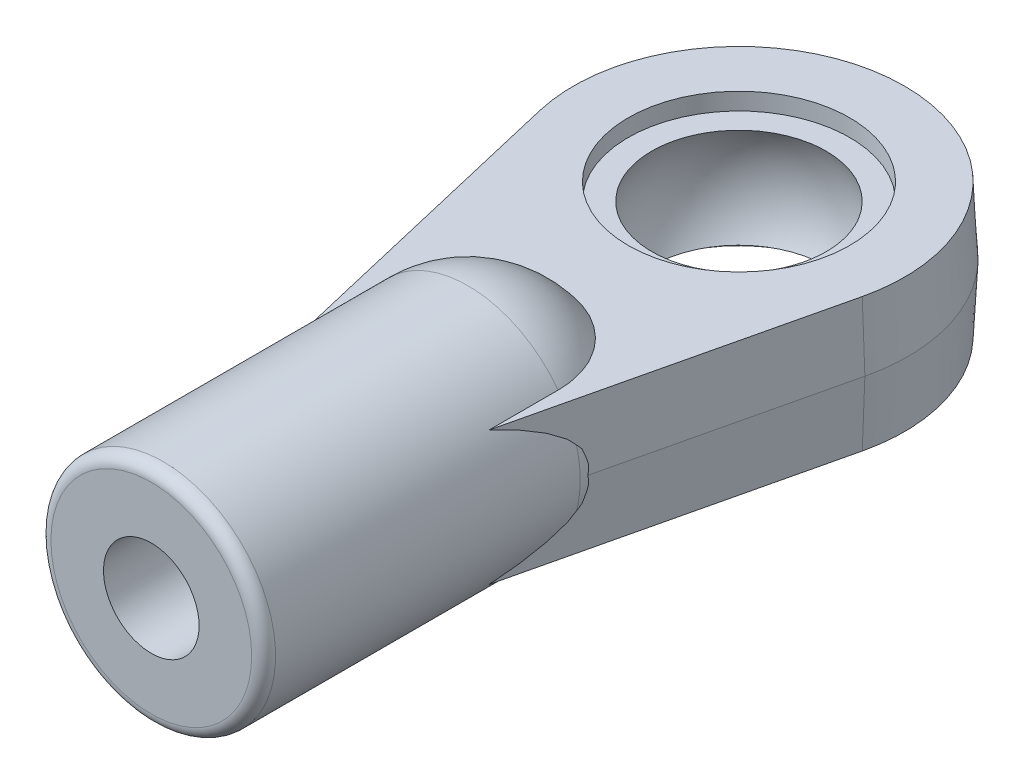
ISO-10303-21;
HEADER;
FILE_DESCRIPTION(('STEP AP214'),'2;1');
FILE_NAME('part.step','',(''),(''),'','','');
FILE_SCHEMA(('AUTOMOTIVE_DESIGN { 1 0 10303 214 1 1 1 1 }'));
ENDSEC;
DATA;
#1=APPLICATION_CONTEXT('core data for automotive mechanical design processes');
#2=APPLICATION_PROTOCOL_DEFINITION('international standard','automotive_design',2000,#1);
#3=PRODUCT_CONTEXT('',#1,'mechanical');
#4=PRODUCT('Part','Part','',(#3));
#5=PRODUCT_RELATED_PRODUCT_CATEGORY('part','',(#4));
#6=PRODUCT_DEFINITION_FORMATION('','',#4);
#7=PRODUCT_DEFINITION_CONTEXT('part definition',#1,'design');
#8=PRODUCT_DEFINITION('design','',#6,#7);
#9=PRODUCT_DEFINITION_SHAPE('','',#8);
#10=(LENGTH_UNIT() NAMED_UNIT(*) SI_UNIT(.MILLI.,.METRE.));
#11=(NAMED_UNIT(*) PLANE_ANGLE_UNIT() SI_UNIT($,.RADIAN.));
#12=(NAMED_UNIT(*) SI_UNIT($,.STERADIAN.) SOLID_ANGLE_UNIT());
#13=UNCERTAINTY_MEASURE_WITH_UNIT(LENGTH_MEASURE(1.E-05),#10,'distance_accuracy_value','');
#14=(GEOMETRIC_REPRESENTATION_CONTEXT(3) GLOBAL_UNCERTAINTY_ASSIGNED_CONTEXT((#13)) GLOBAL_UNIT_ASSIGNED_CONTEXT((#10,
#11,#12)) REPRESENTATION_CONTEXT('',''));
#15=CARTESIAN_POINT('',(0.,0.,0.));
#16=DIRECTION('',(0.,0.,1.));
#17=DIRECTION('',(1.,0.,0.));
#18=AXIS2_PLACEMENT_3D('',#15,#16,#17);
#19=CARTESIAN_POINT('',(0.,1.5875,-18.73885));
#20=DIRECTION('',(0.,1.,0.));
#21=DIRECTION('',(0.,0.,1.));
#22=AXIS2_PLACEMENT_3D('',#19,#20,#21);
#23=PLANE('',#22);
#24=CARTESIAN_POINT('',(0.,1.5875,-18.73885));
#25=DIRECTION('',(0.,1.,0.));
#26=DIRECTION('',(0.,0.,1.));
#27=AXIS2_PLACEMENT_3D('',#24,#25,#26);
#28=CIRCLE('',#27,3.5306);
#29=CARTESIAN_POINT('',(0.,1.5875,-15.20825));
#30=VERTEX_POINT('',#29);
#31=EDGE_CURVE('P0_E21',#30,#30,#28,.T.);
#32=ORIENTED_EDGE('',*,*,#31,.T.);
#33=EDGE_LOOP('',(#32));
#34=FACE_BOUND('',#33,.T.);
#35=CARTESIAN_POINT('',(0.,1.5875,-21.5177713572895));
#36=CARTESIAN_POINT('',(0.0780233970109175,1.5875,-21.5177708897208));
#37=CARTESIAN_POINT('',(0.156061132928654,1.5875,-21.5144824409786));
#38=CARTESIAN_POINT('',(0.311597316268005,1.5875,-21.5013500255618));
#39=CARTESIAN_POINT('',(0.38909559764727,1.5875,-21.4915041234929));
#40=CARTESIAN_POINT('',(0.543117688376616,1.5875,-21.4653010984848));
#41=CARTESIAN_POINT('',(0.61963975090967,1.5875,-21.4489336397251));
#42=CARTESIAN_POINT('',(0.771075578611785,1.5875,-21.4098003250142));
#43=CARTESIAN_POINT('',(0.845987985313132,1.5875,-21.3870292767222));
#44=CARTESIAN_POINT('',(1.06718751098859,1.5875,-21.3094255696959));
#45=CARTESIAN_POINT('',(1.21030919565112,1.5875,-21.2452386063567));
#46=CARTESIAN_POINT('',(1.48372914335094,1.5875,-21.093713605579));
#47=CARTESIAN_POINT('',(1.61402691865729,1.5875,-21.0063746880698));
#48=CARTESIAN_POINT('',(1.7970247350954,1.5875,-20.8599907156731));
#49=CARTESIAN_POINT('',(1.85598367192579,1.5875,-20.808594810804));
#50=CARTESIAN_POINT('',(1.96932163723164,1.5875,-20.7010594238807));
#51=CARTESIAN_POINT('',(2.02370502662113,1.5875,-20.6449245631263));
#52=CARTESIAN_POINT('',(2.12757332441993,1.5875,-20.5282461366586));
#53=CARTESIAN_POINT('',(2.17705600269889,1.5875,-20.4677005853578));
#54=CARTESIAN_POINT('',(2.27074994631359,1.5875,-20.3426616964005));
#55=CARTESIAN_POINT('',(2.31495998807603,1.5875,-20.2781674476397));
#56=CARTESIAN_POINT('',(2.43915822774601,1.5875,-20.0794648960385));
#57=CARTESIAN_POINT('',(2.51082410606128,1.5875,-19.9399134812632));
#58=CARTESIAN_POINT('',(2.62966634363635,1.5875,-19.6508349270353));
#59=CARTESIAN_POINT('',(2.67684296445287,1.5875,-19.5013078941462));
#60=CARTESIAN_POINT('',(2.74543580972441,1.5875,-19.1964365865845));
#61=CARTESIAN_POINT('',(2.76685189660724,1.5875,-19.0410922808496));
#62=CARTESIAN_POINT('',(2.78329356222039,1.5875,-18.7290133036645));
#63=CARTESIAN_POINT('',(2.77831914095071,1.5875,-18.5722786322141));
#64=CARTESIAN_POINT('',(2.74214097095968,1.5875,-18.2618875359936));
#65=CARTESIAN_POINT('',(2.71093736231285,1.5875,-18.108231094789));
#66=CARTESIAN_POINT('',(2.62312852141531,1.5875,-17.8082652710581));
#67=CARTESIAN_POINT('',(2.56652301785846,1.5875,-17.6619559670218));
#68=CARTESIAN_POINT('',(2.46389138915448,1.5875,-17.4513030402927));
#69=CARTESIAN_POINT('',(2.42670294999351,1.5875,-17.3825203687204));
#70=CARTESIAN_POINT('',(2.34666639430291,1.5875,-17.2483286082619));
#71=CARTESIAN_POINT('',(2.30381959030906,1.5875,-17.1829187418847));
#72=CARTESIAN_POINT('',(2.21278651269454,1.5875,-17.0559720709137));
#73=CARTESIAN_POINT('',(2.16460266549794,1.5875,-16.9944335260597));
#74=CARTESIAN_POINT('',(2.06319162073477,1.5875,-16.8755842356939));
#75=CARTESIAN_POINT('',(2.00995960080364,1.5875,-16.8182776276671));
#76=CARTESIAN_POINT('',(1.84335642684013,1.5875,-16.653475168277));
#77=CARTESIAN_POINT('',(1.72295727630919,1.58750000000001,-16.5529284561832));
#78=CARTESIAN_POINT('',(1.46697274328732,1.58749999999999,-16.3735121455689));
#79=CARTESIAN_POINT('',(1.33138793830244,1.58749999999997,-16.2946417230992));
#80=CARTESIAN_POINT('',(1.11956731470582,1.58749999999998,-16.1942246482444));
#81=CARTESIAN_POINT('',(1.04746232878977,1.5875,-16.163708090048));
#82=CARTESIAN_POINT('',(0.900976845737199,1.58750000000001,-16.1088789966126));
#83=CARTESIAN_POINT('',(0.826598245143451,1.5875,-16.0845614405207));
#84=CARTESIAN_POINT('',(0.676182140780832,1.5875,-16.0423192992328));
#85=CARTESIAN_POINT('',(0.60014746021542,1.5875,-16.0243846189846));
#86=CARTESIAN_POINT('',(0.446852225135867,1.5875,-15.9949816333477));
#87=CARTESIAN_POINT('',(0.369592039110233,1.5875,-15.9835114207263));
#88=CARTESIAN_POINT('',(0.243510088508142,1.5875,-15.9701885983606));
#89=CARTESIAN_POINT('',(0.194890190052977,1.5875,-15.9663423325502));
#90=CARTESIAN_POINT('',(0.0975153944611177,1.5875,-15.9612122086222));
#91=CARTESIAN_POINT('',(0.0487604973244243,1.5875,-15.9599283505047));
#92=CARTESIAN_POINT('',(-0.0780233970109172,1.5875,-15.9599291102792));
#93=CARTESIAN_POINT('',(-0.156061132928654,1.5875,-15.9632175590214));
#94=CARTESIAN_POINT('',(-0.311597316268005,1.5875,-15.9763499744382));
#95=CARTESIAN_POINT('',(-0.38909559764727,1.5875,-15.9861958765071));
#96=CARTESIAN_POINT('',(-0.543117688376615,1.5875,-16.0123989015152));
#97=CARTESIAN_POINT('',(-0.619639750909669,1.5875,-16.0287663602749));
#98=CARTESIAN_POINT('',(-0.771075578611784,1.5875,-16.0678996749858));
#99=CARTESIAN_POINT('',(-0.845987985313132,1.5875,-16.0906707232778));
#100=CARTESIAN_POINT('',(-1.06718751098859,1.5875,-16.1682744303041));
#101=CARTESIAN_POINT('',(-1.21030919565111,1.5875,-16.2324613936433));
#102=CARTESIAN_POINT('',(-1.48372914335094,1.5875,-16.383986394421));
#103=CARTESIAN_POINT('',(-1.61402691865729,1.5875,-16.4713253119302));
#104=CARTESIAN_POINT('',(-1.7970247350954,1.5875,-16.6177092843269));
#105=CARTESIAN_POINT('',(-1.85598367192579,1.5875,-16.669105189196));
#106=CARTESIAN_POINT('',(-1.96932163723163,1.5875,-16.7766405761193));
#107=CARTESIAN_POINT('',(-2.02370502662112,1.5875,-16.8327754368737));
#108=CARTESIAN_POINT('',(-2.12757332441993,1.5875,-16.9494538633414));
#109=CARTESIAN_POINT('',(-2.17705600269889,1.5875,-17.0099994146421));
#110=CARTESIAN_POINT('',(-2.27074994631359,1.5875,-17.1350383035995));
#111=CARTESIAN_POINT('',(-2.31495998807602,1.5875,-17.1995325523603));
#112=CARTESIAN_POINT('',(-2.43915822774601,1.5875,-17.3982351039615));
#113=CARTESIAN_POINT('',(-2.51082410606128,1.5875,-17.5377865187368));
#114=CARTESIAN_POINT('',(-2.62966634363635,1.5875,-17.8268650729647));
#115=CARTESIAN_POINT('',(-2.67684296445287,1.5875,-17.9763921058538));
#116=CARTESIAN_POINT('',(-2.74543580972441,1.5875,-18.2812634134155));
#117=CARTESIAN_POINT('',(-2.76685189660724,1.5875,-18.4366077191504));
#118=CARTESIAN_POINT('',(-2.78329356222039,1.5875,-18.7486866963355));
#119=CARTESIAN_POINT('',(-2.77831914095071,1.5875,-18.9054213677859));
#120=CARTESIAN_POINT('',(-2.74214097095968,1.5875,-19.2158124640064));
#121=CARTESIAN_POINT('',(-2.71093736231285,1.5875,-19.369468905211));
#122=CARTESIAN_POINT('',(-2.62312852141531,1.5875,-19.6694347289419));
#123=CARTESIAN_POINT('',(-2.56652301785846,1.5875,-19.8157440329782));
#124=CARTESIAN_POINT('',(-2.46389138915447,1.5875,-20.0263969597073));
#125=CARTESIAN_POINT('',(-2.42670294999351,1.5875,-20.0951796312795));
#126=CARTESIAN_POINT('',(-2.34666639430291,1.5875,-20.2293713917381));
#127=CARTESIAN_POINT('',(-2.30381959030906,1.5875,-20.2947812581153));
#128=CARTESIAN_POINT('',(-2.21278651269455,1.5875,-20.4217279290863));
#129=CARTESIAN_POINT('',(-2.16460266549794,1.5875,-20.4832664739403));
#130=CARTESIAN_POINT('',(-2.06319162073478,1.5875,-20.6021157643061));
#131=CARTESIAN_POINT('',(-2.00995960080364,1.5875,-20.6594223723328));
#132=CARTESIAN_POINT('',(-1.84335642684014,1.5875,-20.824224831723));
#133=CARTESIAN_POINT('',(-1.7229572763092,1.58750000000001,-20.9247715438168));
#134=CARTESIAN_POINT('',(-1.46697274328732,1.58749999999999,-21.1041878544311));
#135=CARTESIAN_POINT('',(-1.33138793830245,1.58749999999996,-21.1830582769008));
#136=CARTESIAN_POINT('',(-1.11956731470582,1.58749999999998,-21.2834753517556));
#137=CARTESIAN_POINT('',(-1.04746232878977,1.58749999999999,-21.313991909952));
#138=CARTESIAN_POINT('',(-0.900976845737205,1.58750000000001,-21.3688210033874));
#139=CARTESIAN_POINT('',(-0.826598245143456,1.5875,-21.3931385594793));
#140=CARTESIAN_POINT('',(-0.676182140780837,1.5875,-21.4353807007672));
#141=CARTESIAN_POINT('',(-0.600147460215425,1.5875,-21.4533153810154));
#142=CARTESIAN_POINT('',(-0.446852225135871,1.5875,-21.4827183666523));
#143=CARTESIAN_POINT('',(-0.369592039110237,1.5875,-21.4941885792737));
#144=CARTESIAN_POINT('',(-0.243510088508145,1.5875,-21.5075114016394));
#145=CARTESIAN_POINT('',(-0.194890190052979,1.5875,-21.5113576674498));
#146=CARTESIAN_POINT('',(-0.0975153944611187,1.5875,-21.5164877913778));
#147=CARTESIAN_POINT('',(-0.0487604973244245,1.5875,-21.5177716494953));
#148=CARTESIAN_POINT('',(0.,1.5875,-21.5177713572895));
#149=B_SPLINE_CURVE_WITH_KNOTS('',3,(#35,#36,#37,#38,#39,#40,#41,#42,#43,#44,#45,#46,#47,#48,
#49,#50,#51,#52,#53,#54,#55,#56,#57,#58,#59,#60,#61,#62,#63,#64,#65,#66,#67,#68,#69,#70,#71,#72,
#73,#74,#75,#76,#77,#78,#79,#80,#81,#82,#83,#84,#85,#86,#87,#88,#89,#90,#91,#92,#93,#94,#95,#96,
#97,#98,#99,#100,#101,#102,#103,#104,#105,#106,#107,#108,#109,#110,#111,#112,#113,#114,#115,
#116,#117,#118,#119,#120,#121,#122,#123,#124,#125,#126,#127,#128,#129,#130,#131,#132,#133,#134,
#135,#136,#137,#138,#139,#140,#141,#142,#143,#144,#145,#146,#147,#148),.UNSPECIFIED.,.T.,.F.,(4,
2,2,2,2,2,2,2,2,2,2,2,2,2,2,2,2,2,2,2,2,2,2,2,2,2,2,2,2,2,2,2,2,2,2,2,2,2,2,2,2,2,2,2,2,2,2,2,2,
2,2,2,2,2,2,2,4),(0.,0.234025302373472,0.46811970658274,0.702586605236248,0.93724417192487,
1.40544072040476,1.87365506889924,2.10806901100275,2.34225694275971,2.57655095968591,
2.81089924175706,3.27910719063613,3.74731013873254,4.21551558722033,4.68372103570813,
5.15192398380455,5.62013193268361,5.85448021475476,6.08877423168096,6.32296216343792,
6.55737610554143,7.02559045403588,7.49378700251573,7.72844456920437,7.9629114678579,
8.19700587206719,8.43103117444068,8.57728461337557,8.72353805231047,8.95756335468394,
9.19165775889321,9.42612465754672,9.66078222423534,10.1289787727152,10.5971931212097,
10.8316070633132,11.0657949950702,11.3000890119964,11.5344372940675,12.0026452429466,
12.470848191043,12.9390536395308,13.4072590880186,13.875462036115,14.3436699849941,
14.5780182670652,14.8123122839914,15.0465002157484,15.2809141578519,15.7491285063463,
16.2173250548262,16.4519826215148,16.6864495201684,16.9205439243777,17.1545692267511,
17.300822665686,17.4470761046209),.UNSPECIFIED.);
#150=CARTESIAN_POINT('',(0.,1.5875,-21.5177713572895));
#151=VERTEX_POINT('',#150);
#152=EDGE_CURVE('P0_E244',#151,#151,#149,.T.);
#153=ORIENTED_EDGE('',*,*,#152,.T.);
#154=EDGE_LOOP('',(#153));
#155=FACE_BOUND('',#154,.T.);
#156=ADVANCED_FACE('P0_F17',(#34,#155),#23,.T.);
#157=CARTESIAN_POINT('',(0.,1.5875,-18.73885));
#158=DIRECTION('',(0.,1.,0.));
#159=DIRECTION('',(0.,0.,1.));
#160=AXIS2_PLACEMENT_3D('',#157,#158,#159);
#161=CYLINDRICAL_SURFACE('',#160,3.5306);
#162=CARTESIAN_POINT('',(0.,2.1336,-18.73885));
#163=DIRECTION('',(0.,1.,0.));
#164=DIRECTION('',(0.,0.,1.));
#165=AXIS2_PLACEMENT_3D('',#162,#163,#164);
#166=CIRCLE('',#165,3.5306);
#167=CARTESIAN_POINT('',(0.,2.1336,-15.20825));
#168=VERTEX_POINT('',#167);
#169=EDGE_CURVE('P0_E239',#168,#168,#166,.F.);
#170=ORIENTED_EDGE('',*,*,#169,.F.);
#171=EDGE_LOOP('',(#170));
#172=FACE_BOUND('',#171,.T.);
#173=ORIENTED_EDGE('',*,*,#31,.F.);
#174=EDGE_LOOP('',(#173));
#175=FACE_BOUND('',#174,.T.);
#176=ADVANCED_FACE('P0_F77',(#172,#175),#161,.F.);
#177=CARTESIAN_POINT('',(0.,0.,-12.0142000001238));
#178=DIRECTION('',(0.,0.,1.));
#179=DIRECTION('',(1.,0.,0.));
#180=AXIS2_PLACEMENT_3D('',#177,#178,#179);
#181=CONICAL_SURFACE('',#180,1.52399999979025,1.02974425846679);
#182=CARTESIAN_POINT('',(-2.55795384873636E-10,0.,-12.9299115835408));
#183=VERTEX_POINT('',#182);
#184=VERTEX_LOOP('',#183);
#185=FACE_BOUND('',#184,.T.);
#186=CARTESIAN_POINT('',(0.,0.,-12.0142));
#187=DIRECTION('',(0.,0.,1.));
#188=DIRECTION('',(1.,0.,0.));
#189=AXIS2_PLACEMENT_3D('',#186,#187,#188);
#190=CIRCLE('',#189,1.524);
#191=CARTESIAN_POINT('',(1.524,0.,-12.0142));
#192=VERTEX_POINT('',#191);
#193=EDGE_CURVE('P0_E81',#192,#192,#190,.T.);
#194=ORIENTED_EDGE('',*,*,#193,.T.);
#195=EDGE_LOOP('',(#194));
#196=FACE_BOUND('',#195,.T.);
#197=ADVANCED_FACE('P0_F73',(#185,#196),#181,.F.);
#198=CARTESIAN_POINT('',(-2.62620354632618,0.,-6.35));
#199=DIRECTION('',(0.,0.0523359562429439,0.998629534754574));
#200=DIRECTION('',(0.,-0.998629534754574,0.0523359562429439));
#201=AXIS2_PLACEMENT_3D('',#198,#199,#200);
#202=PLANE('',#201);
#203=DIRECTION('',(1.,0.,0.));
#204=VECTOR('',#203,1.);
#205=CARTESIAN_POINT('',(0.,2.1336,-6.4618172378783));
#206=LINE('',#205,#204);
#207=CARTESIAN_POINT('',(-2.53762061529938,2.1336,-6.4618172378783));
#208=VERTEX_POINT('',#207);
#209=CARTESIAN_POINT('',(2.53762061529963,2.1336,-6.4618172378783));
#210=VERTEX_POINT('',#209);
#211=EDGE_CURVE('P0_E230',#208,#210,#206,.T.);
#212=ORIENTED_EDGE('',*,*,#211,.F.);
#213=DIRECTION('',(0.0414255695402248,0.997772303834552,-0.0522910306740929));
#214=VECTOR('',#213,1.);
#215=CARTESIAN_POINT('',(-2.62620354632618,0.,-6.35));
#216=LINE('',#215,#214);
#217=CARTESIAN_POINT('',(-2.62620354632618,0.,-6.35));
#218=VERTEX_POINT('',#217);
#219=EDGE_CURVE('P0_E89',#218,#208,#216,.T.);
#220=ORIENTED_EDGE('',*,*,#219,.F.);
#221=DIRECTION('',(1.,0.,0.));
#222=VECTOR('',#221,1.);
#223=CARTESIAN_POINT('',(-2.62620354632618,0.,-6.35));
#224=LINE('',#223,#222);
#225=CARTESIAN_POINT('',(-1.524,0.,-6.35));
#226=VERTEX_POINT('',#225);
#227=EDGE_CURVE('P0_E69',#218,#226,#224,.T.);
#228=ORIENTED_EDGE('',*,*,#227,.T.);
#229=CARTESIAN_POINT('',(0.,0.,-6.35));
#230=DIRECTION('',(0.,0.0523359562429439,0.998629534754574));
#231=DIRECTION('',(0.,-0.998629534754574,0.0523359562429439));
#232=AXIS2_PLACEMENT_3D('',#229,#230,#231);
#233=ELLIPSE('',#232,1.52609145530083,1.524);
#234=CARTESIAN_POINT('',(1.524,0.,-6.35));
#235=VERTEX_POINT('',#234);
#236=EDGE_CURVE('P0_E240',#226,#235,#233,.F.);
#237=ORIENTED_EDGE('',*,*,#236,.T.);
#238=DIRECTION('',(1.,0.,0.));
#239=VECTOR('',#238,1.);
#240=CARTESIAN_POINT('',(-2.62620354632618,0.,-6.35));
#241=LINE('',#240,#239);
#242=CARTESIAN_POINT('',(2.62620354632643,0.,-6.35));
#243=VERTEX_POINT('',#242);
#244=EDGE_CURVE('P0_E181',#235,#243,#241,.T.);
#245=ORIENTED_EDGE('',*,*,#244,.T.);
#246=DIRECTION('',(0.0414255695402248,-0.997772303834552,0.0522910306740929));
#247=VECTOR('',#246,1.);
#248=CARTESIAN_POINT('',(2.53762061529963,2.1336,-6.4618172378783));
#249=LINE('',#248,#247);
#250=EDGE_CURVE('P0_E87',#210,#243,#249,.T.);
#251=ORIENTED_EDGE('',*,*,#250,.F.);
#252=EDGE_LOOP('',(#212,#220,#228,#237,#245,#251));
#253=FACE_BOUND('',#252,.T.);
#254=ADVANCED_FACE('P0_F76',(#253),#202,.T.);
#255=CARTESIAN_POINT('',(0.,2.1336,-18.73885));
#256=DIRECTION('',(0.,1.,0.));
#257=DIRECTION('',(0.,0.,1.));
#258=AXIS2_PLACEMENT_3D('',#255,#256,#257);
#259=PLANE('',#258);
#260=ORIENTED_EDGE('',*,*,#211,.T.);
#261=DIRECTION('',(0.228803541615055,0.,-0.973472618692692));
#262=VECTOR('',#261,1.);
#263=CARTESIAN_POINT('',(5.13928588889286,2.13360000000001,-17.5309199666622));
#264=LINE('',#263,#262);
#265=CARTESIAN_POINT('',(5.139285888895,2.13360000001282,-17.5309199666613));
#266=VERTEX_POINT('',#265);
#267=EDGE_CURVE('P0_E83',#266,#210,#264,.F.);
#268=ORIENTED_EDGE('',*,*,#267,.F.);
#269=CARTESIAN_POINT('',(0.,2.1335999999792,-18.73885));
#270=DIRECTION('',(0.,-1.,0.));
#271=DIRECTION('',(0.,0.,-1.));
#272=AXIS2_PLACEMENT_3D('',#269,#270,#271);
#273=CIRCLE('',#272,5.27933276212576);
#274=CARTESIAN_POINT('',(-5.1392858888958,2.13360000001282,-17.5309199666612));
#275=VERTEX_POINT('',#274);
#276=EDGE_CURVE('P0_E114',#275,#266,#273,.T.);
#277=ORIENTED_EDGE('',*,*,#276,.F.);
#278=DIRECTION('',(0.228803541615055,0.,0.973472618692692));
#279=VECTOR('',#278,1.);
#280=CARTESIAN_POINT('',(-3.47254898062763,2.1336,-10.4395841800412));
#281=LINE('',#280,#279);
#282=EDGE_CURVE('P0_E84',#208,#275,#281,.F.);
#283=ORIENTED_EDGE('',*,*,#282,.F.);
#284=EDGE_LOOP('',(#260,#268,#277,#283));
#285=FACE_BOUND('',#284,.T.);
#286=ORIENTED_EDGE('',*,*,#169,.T.);
#287=EDGE_LOOP('',(#286));
#288=FACE_BOUND('',#287,.T.);
#289=ADVANCED_FACE('P0_F147',(#285,#288),#259,.T.);
#290=CARTESIAN_POINT('',(0.,0.,-18.73885));
#291=DIRECTION('',(-1.,0.,0.));
#292=DIRECTION('',(0.,0.,1.));
#293=AXIS2_PLACEMENT_3D('',#290,#291,#292);
#294=SPHERICAL_SURFACE('',#293,3.2004);
#295=CARTESIAN_POINT('',(3.2004,0.,-18.73885));
#296=VERTEX_POINT('',#295);
#297=VERTEX_LOOP('',#296);
#298=FACE_BOUND('',#297,.T.);
#299=CARTESIAN_POINT('',(-3.2004,0.,-18.73885));
#300=VERTEX_POINT('',#299);
#301=VERTEX_LOOP('',#300);
#302=FACE_BOUND('',#301,.T.);
#303=CARTESIAN_POINT('',(0.,-1.5875,-21.5177713572895));
#304=CARTESIAN_POINT('',(-0.0780233970109173,-1.5875,-21.5177708897208));
#305=CARTESIAN_POINT('',(-0.156061132928654,-1.5875,-21.5144824409786));
#306=CARTESIAN_POINT('',(-0.311597316268005,-1.5875,-21.5013500255618));
#307=CARTESIAN_POINT('',(-0.38909559764727,-1.5875,-21.4915041234929));
#308=CARTESIAN_POINT('',(-0.543117688376615,-1.5875,-21.4653010984848));
#309=CARTESIAN_POINT('',(-0.619639750909669,-1.5875,-21.4489336397251));
#310=CARTESIAN_POINT('',(-0.771075578611784,-1.5875,-21.4098003250142));
#311=CARTESIAN_POINT('',(-0.845987985313132,-1.5875,-21.3870292767222));
#312=CARTESIAN_POINT('',(-1.06718751098859,-1.5875,-21.3094255696959));
#313=CARTESIAN_POINT('',(-1.21030919565111,-1.5875,-21.2452386063567));
#314=CARTESIAN_POINT('',(-1.48372914335094,-1.5875,-21.093713605579));
#315=CARTESIAN_POINT('',(-1.61402691865729,-1.5875,-21.0063746880698));
#316=CARTESIAN_POINT('',(-1.7970247350954,-1.5875,-20.8599907156731));
#317=CARTESIAN_POINT('',(-1.85598367192579,-1.5875,-20.808594810804));
#318=CARTESIAN_POINT('',(-1.96932163723163,-1.5875,-20.7010594238807));
#319=CARTESIAN_POINT('',(-2.02370502662112,-1.5875,-20.6449245631263));
#320=CARTESIAN_POINT('',(-2.12757332441993,-1.5875,-20.5282461366586));
#321=CARTESIAN_POINT('',(-2.17705600269889,-1.5875,-20.4677005853578));
#322=CARTESIAN_POINT('',(-2.27074994631359,-1.5875,-20.3426616964005));
#323=CARTESIAN_POINT('',(-2.31495998807602,-1.5875,-20.2781674476397));
#324=CARTESIAN_POINT('',(-2.43915822774601,-1.5875,-20.0794648960385));
#325=CARTESIAN_POINT('',(-2.51082410606128,-1.5875,-19.9399134812632));
#326=CARTESIAN_POINT('',(-2.62966634363635,-1.5875,-19.6508349270353));
#327=CARTESIAN_POINT('',(-2.67684296445287,-1.5875,-19.5013078941462));
#328=CARTESIAN_POINT('',(-2.74543580972441,-1.5875,-19.1964365865845));
#329=CARTESIAN_POINT('',(-2.76685189660724,-1.5875,-19.0410922808496));
#330=CARTESIAN_POINT('',(-2.78329356222039,-1.5875,-18.7290133036644));
#331=CARTESIAN_POINT('',(-2.77831914095071,-1.5875,-18.5722786322141));
#332=CARTESIAN_POINT('',(-2.74214097095968,-1.5875,-18.2618875359936));
#333=CARTESIAN_POINT('',(-2.71093736231285,-1.5875,-18.108231094789));
#334=CARTESIAN_POINT('',(-2.62312852141531,-1.5875,-17.808265271058));
#335=CARTESIAN_POINT('',(-2.56652301785846,-1.5875,-17.6619559670218));
#336=CARTESIAN_POINT('',(-2.46389138915448,-1.5875,-17.4513030402927));
#337=CARTESIAN_POINT('',(-2.42670294999351,-1.5875,-17.3825203687204));
#338=CARTESIAN_POINT('',(-2.34666639430291,-1.5875,-17.2483286082619));
#339=CARTESIAN_POINT('',(-2.30381959030906,-1.5875,-17.1829187418847));
#340=CARTESIAN_POINT('',(-2.21278651269455,-1.5875,-17.0559720709137));
#341=CARTESIAN_POINT('',(-2.16460266549794,-1.5875,-16.9944335260597));
#342=CARTESIAN_POINT('',(-2.06319162073478,-1.5875,-16.8755842356939));
#343=CARTESIAN_POINT('',(-2.00995960080364,-1.5875,-16.8182776276671));
#344=CARTESIAN_POINT('',(-1.84335642684013,-1.5875,-16.653475168277));
#345=CARTESIAN_POINT('',(-1.7229572763092,-1.58750000000001,-16.5529284561832));
#346=CARTESIAN_POINT('',(-1.46697274328732,-1.58749999999999,-16.3735121455689));
#347=CARTESIAN_POINT('',(-1.33138793830244,-1.58749999999997,-16.2946417230992));
#348=CARTESIAN_POINT('',(-1.11956731470582,-1.58749999999998,-16.1942246482444));
#349=CARTESIAN_POINT('',(-1.04746232878977,-1.5875,-16.163708090048));
#350=CARTESIAN_POINT('',(-0.900976845737201,-1.58750000000001,-16.1088789966126));
#351=CARTESIAN_POINT('',(-0.826598245143452,-1.5875,-16.0845614405207));
#352=CARTESIAN_POINT('',(-0.676182140780833,-1.5875,-16.0423192992328));
#353=CARTESIAN_POINT('',(-0.600147460215421,-1.5875,-16.0243846189846));
#354=CARTESIAN_POINT('',(-0.446852225135867,-1.5875,-15.9949816333477));
#355=CARTESIAN_POINT('',(-0.369592039110233,-1.5875,-15.9835114207263));
#356=CARTESIAN_POINT('',(-0.243510088508142,-1.5875,-15.9701885983606));
#357=CARTESIAN_POINT('',(-0.194890190052977,-1.5875,-15.9663423325502));
#358=CARTESIAN_POINT('',(-0.0975153944611174,-1.5875,-15.9612122086222));
#359=CARTESIAN_POINT('',(-0.0487604973244239,-1.5875,-15.9599283505047));
#360=CARTESIAN_POINT('',(0.0780233970109176,-1.5875,-15.9599291102792));
#361=CARTESIAN_POINT('',(0.156061132928654,-1.5875,-15.9632175590214));
#362=CARTESIAN_POINT('',(0.311597316268005,-1.5875,-15.9763499744382));
#363=CARTESIAN_POINT('',(0.38909559764727,-1.5875,-15.9861958765071));
#364=CARTESIAN_POINT('',(0.543117688376616,-1.5875,-16.0123989015152));
#365=CARTESIAN_POINT('',(0.61963975090967,-1.5875,-16.0287663602749));
#366=CARTESIAN_POINT('',(0.771075578611785,-1.5875,-16.0678996749858));
#367=CARTESIAN_POINT('',(0.845987985313132,-1.5875,-16.0906707232778));
#368=CARTESIAN_POINT('',(1.06718751098859,-1.5875,-16.1682744303041));
#369=CARTESIAN_POINT('',(1.21030919565112,-1.5875,-16.2324613936433));
#370=CARTESIAN_POINT('',(1.48372914335094,-1.5875,-16.383986394421));
#371=CARTESIAN_POINT('',(1.61402691865729,-1.5875,-16.4713253119302));
#372=CARTESIAN_POINT('',(1.7970247350954,-1.5875,-16.6177092843269));
#373=CARTESIAN_POINT('',(1.85598367192579,-1.5875,-16.669105189196));
#374=CARTESIAN_POINT('',(1.96932163723163,-1.5875,-16.7766405761193));
#375=CARTESIAN_POINT('',(2.02370502662112,-1.5875,-16.8327754368737));
#376=CARTESIAN_POINT('',(2.12757332441993,-1.5875,-16.9494538633414));
#377=CARTESIAN_POINT('',(2.17705600269889,-1.5875,-17.0099994146421));
#378=CARTESIAN_POINT('',(2.27074994631359,-1.5875,-17.1350383035995));
#379=CARTESIAN_POINT('',(2.31495998807602,-1.5875,-17.1995325523603));
#380=CARTESIAN_POINT('',(2.43915822774601,-1.5875,-17.3982351039615));
#381=CARTESIAN_POINT('',(2.51082410606128,-1.5875,-17.5377865187368));
#382=CARTESIAN_POINT('',(2.62966634363635,-1.5875,-17.8268650729647));
#383=CARTESIAN_POINT('',(2.67684296445287,-1.5875,-17.9763921058538));
#384=CARTESIAN_POINT('',(2.74543580972441,-1.5875,-18.2812634134155));
#385=CARTESIAN_POINT('',(2.76685189660724,-1.5875,-18.4366077191504));
#386=CARTESIAN_POINT('',(2.78329356222039,-1.5875,-18.7486866963356));
#387=CARTESIAN_POINT('',(2.77831914095071,-1.5875,-18.9054213677859));
#388=CARTESIAN_POINT('',(2.74214097095968,-1.5875,-19.2158124640064));
#389=CARTESIAN_POINT('',(2.71093736231285,-1.5875,-19.369468905211));
#390=CARTESIAN_POINT('',(2.62312852141531,-1.5875,-19.6694347289419));
#391=CARTESIAN_POINT('',(2.56652301785846,-1.5875,-19.8157440329782));
#392=CARTESIAN_POINT('',(2.46389138915448,-1.5875,-20.0263969597073));
#393=CARTESIAN_POINT('',(2.42670294999351,-1.5875,-20.0951796312795));
#394=CARTESIAN_POINT('',(2.34666639430291,-1.5875,-20.2293713917381));
#395=CARTESIAN_POINT('',(2.30381959030906,-1.5875,-20.2947812581153));
#396=CARTESIAN_POINT('',(2.21278651269455,-1.5875,-20.4217279290863));
#397=CARTESIAN_POINT('',(2.16460266549794,-1.5875,-20.4832664739403));
#398=CARTESIAN_POINT('',(2.06319162073477,-1.5875,-20.6021157643061));
#399=CARTESIAN_POINT('',(2.00995960080364,-1.5875,-20.6594223723329));
#400=CARTESIAN_POINT('',(1.84335642684013,-1.5875,-20.824224831723));
#401=CARTESIAN_POINT('',(1.7229572763092,-1.58750000000001,-20.9247715438168));
#402=CARTESIAN_POINT('',(1.46697274328732,-1.58749999999999,-21.1041878544311));
#403=CARTESIAN_POINT('',(1.33138793830244,-1.58749999999997,-21.1830582769008));
#404=CARTESIAN_POINT('',(1.11956731470582,-1.58749999999998,-21.2834753517556));
#405=CARTESIAN_POINT('',(1.04746232878977,-1.5875,-21.313991909952));
#406=CARTESIAN_POINT('',(0.900976845737201,-1.58750000000001,-21.3688210033874));
#407=CARTESIAN_POINT('',(0.826598245143454,-1.5875,-21.3931385594793));
#408=CARTESIAN_POINT('',(0.676182140780835,-1.5875,-21.4353807007672));
#409=CARTESIAN_POINT('',(0.600147460215423,-1.5875,-21.4533153810154));
#410=CARTESIAN_POINT('',(0.446852225135868,-1.5875,-21.4827183666523));
#411=CARTESIAN_POINT('',(0.369592039110234,-1.5875,-21.4941885792737));
#412=CARTESIAN_POINT('',(0.243510088508143,-1.5875,-21.5075114016394));
#413=CARTESIAN_POINT('',(0.194890190052978,-1.5875,-21.5113576674498));
#414=CARTESIAN_POINT('',(0.0975153944611182,-1.5875,-21.5164877913778));
#415=CARTESIAN_POINT('',(0.0487604973244245,-1.5875,-21.5177716494953));
#416=CARTESIAN_POINT('',(0.,-1.5875,-21.5177713572895));
#417=B_SPLINE_CURVE_WITH_KNOTS('',3,(#303,#304,#305,#306,#307,#308,#309,#310,#311,#312,#313,
#314,#315,#316,#317,#318,#319,#320,#321,#322,#323,#324,#325,#326,#327,#328,#329,#330,#331,#332,
#333,#334,#335,#336,#337,#338,#339,#340,#341,#342,#343,#344,#345,#346,#347,#348,#349,#350,#351,
#352,#353,#354,#355,#356,#357,#358,#359,#360,#361,#362,#363,#364,#365,#366,#367,#368,#369,#370,
#371,#372,#373,#374,#375,#376,#377,#378,#379,#380,#381,#382,#383,#384,#385,#386,#387,#388,#389,
#390,#391,#392,#393,#394,#395,#396,#397,#398,#399,#400,#401,#402,#403,#404,#405,#406,#407,#408,
#409,#410,#411,#412,#413,#414,#415,#416),.UNSPECIFIED.,.T.,.F.,(4,2,2,2,2,2,2,2,2,2,2,2,2,2,2,2,
2,2,2,2,2,2,2,2,2,2,2,2,2,2,2,2,2,2,2,2,2,2,2,2,2,2,2,2,2,2,2,2,2,2,2,2,2,2,2,2,4),(0.,
0.234025302373472,0.468119706582741,0.702586605236248,0.937244171924871,1.40544072040476,
1.87365506889924,2.10806901100275,2.34225694275971,2.57655095968591,2.81089924175706,
3.27910719063612,3.74731013873255,4.21551558722034,4.68372103570813,5.15192398380455,
5.62013193268361,5.85448021475476,6.08877423168096,6.32296216343792,6.55737610554143,
7.02559045403588,7.49378700251574,7.72844456920438,7.9629114678579,8.19700587206719,
8.43103117444068,8.57728461337557,8.72353805231047,8.95756335468394,9.19165775889321,
9.42612465754672,9.66078222423534,10.1289787727152,10.5971931212097,10.8316070633132,
11.0657949950702,11.3000890119964,11.5344372940675,12.0026452429466,12.470848191043,
12.9390536395308,13.4072590880186,13.875462036115,14.3436699849941,14.5780182670652,
14.8123122839914,15.0465002157484,15.2809141578519,15.7491285063463,16.2173250548262,
16.4519826215148,16.6864495201684,16.9205439243777,17.1545692267511,17.300822665686,
17.4470761046209),.UNSPECIFIED.);
#418=CARTESIAN_POINT('',(0.,-1.5875,-21.5177713572895));
#419=VERTEX_POINT('',#418);
#420=EDGE_CURVE('P0_E106',#419,#419,#417,.T.);
#421=ORIENTED_EDGE('',*,*,#420,.F.);
#422=EDGE_LOOP('',(#421));
#423=FACE_BOUND('',#422,.T.);
#424=ORIENTED_EDGE('',*,*,#152,.F.);
#425=EDGE_LOOP('',(#424));
#426=FACE_BOUND('',#425,.T.);
#427=ADVANCED_FACE('P0_F116',(#298,#302,#423,#426),#294,.F.);
#428=CARTESIAN_POINT('',(-3.5814,0.,-10.4140000000011));
#429=DIRECTION('',(-0.9721385083014,0.0523359562429439,0.228489974313242));
#430=DIRECTION('',(0.228803541615055,0.,0.973472618692692));
#431=AXIS2_PLACEMENT_3D('',#428,#429,#430);
#432=PLANE('',#431);
#433=ORIENTED_EDGE('',*,*,#282,.T.);
#434=DIRECTION('',(0.0509476203756049,0.998629534754574,-0.0119746521421956));
#435=VECTOR('',#434,1.);
#436=CARTESIAN_POINT('',(-25462.9996680352,-499000.,5966.04633277495));
#437=LINE('',#436,#435);
#438=CARTESIAN_POINT('',(-5.24813690826712,0.,-17.5053357866217));
#439=VERTEX_POINT('',#438);
#440=EDGE_CURVE('P0_E215',#439,#275,#437,.T.);
#441=ORIENTED_EDGE('',*,*,#440,.F.);
#442=DIRECTION('',(0.228803541615055,0.,0.973472618692692));
#443=VECTOR('',#442,1.);
#444=CARTESIAN_POINT('',(-3.5814,0.,-10.4140000000011));
#445=LINE('',#444,#443);
#446=EDGE_CURVE('P0_E105',#218,#439,#445,.F.);
#447=ORIENTED_EDGE('',*,*,#446,.F.);
#448=ORIENTED_EDGE('',*,*,#219,.T.);
#449=EDGE_LOOP('',(#433,#441,#447,#448));
#450=FACE_BOUND('',#449,.T.);
#451=ADVANCED_FACE('P0_F139',(#450),#432,.T.);
#452=CARTESIAN_POINT('',(0.,0.,0.));
#453=DIRECTION('',(0.,0.,1.));
#454=DIRECTION('',(1.,0.,0.));
#455=AXIS2_PLACEMENT_3D('',#452,#453,#454);
#456=CYLINDRICAL_SURFACE('',#455,1.524);
#457=CARTESIAN_POINT('',(0.,0.,-6.35));
#458=DIRECTION('',(0.,-0.0523359562429439,0.998629534754574));
#459=DIRECTION('',(0.,0.998629534754574,0.0523359562429439));
#460=AXIS2_PLACEMENT_3D('',#457,#458,#459);
#461=ELLIPSE('',#460,1.52609145530083,1.524);
#462=EDGE_CURVE('P0_E102',#235,#226,#461,.F.);
#463=ORIENTED_EDGE('',*,*,#462,.F.);
#464=ORIENTED_EDGE('',*,*,#236,.F.);
#465=EDGE_LOOP('',(#463,#464));
#466=FACE_BOUND('',#465,.T.);
#467=ORIENTED_EDGE('',*,*,#193,.F.);
#468=EDGE_LOOP('',(#467));
#469=FACE_BOUND('',#468,.T.);
#470=ADVANCED_FACE('P0_F136',(#466,#469),#456,.F.);
#471=CARTESIAN_POINT('',(5.24813690826523,0.,-17.5053357866221));
#472=DIRECTION('',(0.9721385083014,0.0523359562429439,0.228489974313241));
#473=DIRECTION('',(0.228803541615055,0.,-0.973472618692692));
#474=AXIS2_PLACEMENT_3D('',#471,#472,#473);
#475=PLANE('',#474);
#476=ORIENTED_EDGE('',*,*,#267,.T.);
#477=ORIENTED_EDGE('',*,*,#250,.T.);
#478=DIRECTION('',(0.228803541615055,0.,-0.973472618692692));
#479=VECTOR('',#478,1.);
#480=CARTESIAN_POINT('',(5.24813690826523,0.,-17.5053357866221));
#481=LINE('',#480,#479);
#482=CARTESIAN_POINT('',(5.24813690826537,0.,-17.5053357866215));
#483=VERTEX_POINT('',#482);
#484=EDGE_CURVE('P0_E191',#483,#243,#481,.F.);
#485=ORIENTED_EDGE('',*,*,#484,.F.);
#486=DIRECTION('',(-0.050947620375605,0.998629534754574,-0.011974652142195));
#487=VECTOR('',#486,1.);
#488=CARTESIAN_POINT('',(25462.9996680353,-499000.,5966.04633277466));
#489=LINE('',#488,#487);
#490=EDGE_CURVE('P0_E113',#266,#483,#489,.F.);
#491=ORIENTED_EDGE('',*,*,#490,.F.);
#492=EDGE_LOOP('',(#476,#477,#485,#491));
#493=FACE_BOUND('',#492,.T.);
#494=ADVANCED_FACE('P0_F132',(#493),#475,.T.);
#495=CARTESIAN_POINT('',(0.,5.6843418860808E-11,-18.73885));
#496=DIRECTION('',(0.,-1.,0.));
#497=DIRECTION('',(0.,0.,-1.));
#498=AXIS2_PLACEMENT_3D('',#495,#496,#497);
#499=CONICAL_SURFACE('',#498,5.39115000000292,0.0523598775611997);
#500=ORIENTED_EDGE('',*,*,#276,.T.);
#501=ORIENTED_EDGE('',*,*,#490,.T.);
#502=CARTESIAN_POINT('',(0.,0.,-18.73885));
#503=DIRECTION('',(0.,1.,0.));
#504=DIRECTION('',(0.,0.,1.));
#505=AXIS2_PLACEMENT_3D('',#502,#503,#504);
#506=CIRCLE('',#505,5.39115000000292);
#507=EDGE_CURVE('P0_E190',#439,#483,#506,.F.);
#508=ORIENTED_EDGE('',*,*,#507,.F.);
#509=ORIENTED_EDGE('',*,*,#440,.T.);
#510=EDGE_LOOP('',(#500,#501,#508,#509));
#511=FACE_BOUND('',#510,.T.);
#512=ADVANCED_FACE('P0_F127',(#511),#499,.T.);
#513=CARTESIAN_POINT('',(0.,-1.5875,-18.73885));
#514=DIRECTION('',(0.,-1.,0.));
#515=DIRECTION('',(0.,0.,-1.));
#516=AXIS2_PLACEMENT_3D('',#513,#514,#515);
#517=PLANE('',#516);
#518=CARTESIAN_POINT('',(0.,-1.5875,-18.73885));
#519=DIRECTION('',(0.,-1.,0.));
#520=DIRECTION('',(0.,0.,-1.));
#521=AXIS2_PLACEMENT_3D('',#518,#519,#520);
#522=CIRCLE('',#521,3.5306);
#523=CARTESIAN_POINT('',(0.,-1.5875,-22.26945));
#524=VERTEX_POINT('',#523);
#525=EDGE_CURVE('P0_E97',#524,#524,#522,.T.);
#526=ORIENTED_EDGE('',*,*,#525,.T.);
#527=EDGE_LOOP('',(#526));
#528=FACE_BOUND('',#527,.T.);
#529=ORIENTED_EDGE('',*,*,#420,.T.);
#530=EDGE_LOOP('',(#529));
#531=FACE_BOUND('',#530,.T.);
#532=ADVANCED_FACE('P0_F121',(#528,#531),#517,.T.);
#533=CARTESIAN_POINT('',(-3.5814,0.,-10.4140000000011));
#534=DIRECTION('',(-0.9721385083014,-0.0523359562429439,0.228489974313242));
#535=DIRECTION('',(0.228803541615055,0.,0.973472618692692));
#536=AXIS2_PLACEMENT_3D('',#533,#534,#535);
#537=PLANE('',#536);
#538=DIRECTION('',(0.228803541615066,0.,0.97347261869269));
#539=VECTOR('',#538,1.);
#540=CARTESIAN_POINT('',(-5.13928588889273,-2.1336,-17.5309199666622));
#541=LINE('',#540,#539);
#542=CARTESIAN_POINT('',(-5.13928588889592,-2.13360000001282,-17.5309199666618));
#543=VERTEX_POINT('',#542);
#544=CARTESIAN_POINT('',(-2.53762061529938,-2.1336,-6.4618172378783));
#545=VERTEX_POINT('',#544);
#546=EDGE_CURVE('P0_E100',#543,#545,#541,.T.);
#547=ORIENTED_EDGE('',*,*,#546,.T.);
#548=DIRECTION('',(0.0414255695402248,-0.997772303834552,-0.0522910306740929));
#549=VECTOR('',#548,1.);
#550=CARTESIAN_POINT('',(-2.62620354632618,0.,-6.35));
#551=LINE('',#550,#549);
#552=EDGE_CURVE('P0_E104',#218,#545,#551,.T.);
#553=ORIENTED_EDGE('',*,*,#552,.F.);
#554=ORIENTED_EDGE('',*,*,#446,.T.);
#555=DIRECTION('',(0.0509476203756049,-0.998629534754574,-0.0119746521421956));
#556=VECTOR('',#555,1.);
#557=CARTESIAN_POINT('',(-25462.9996680352,499000.,5966.04633277493));
#558=LINE('',#557,#556);
#559=EDGE_CURVE('P0_E101',#543,#439,#558,.F.);
#560=ORIENTED_EDGE('',*,*,#559,.F.);
#561=EDGE_LOOP('',(#547,#553,#554,#560));
#562=FACE_BOUND('',#561,.T.);
#563=ADVANCED_FACE('P0_F126',(#562),#537,.T.);
#564=CARTESIAN_POINT('',(-2.62620354632618,0.,-6.35));
#565=DIRECTION('',(0.,-0.0523359562429439,0.998629534754574));
#566=DIRECTION('',(0.,-0.998629534754574,-0.0523359562429439));
#567=AXIS2_PLACEMENT_3D('',#564,#565,#566);
#568=PLANE('',#567);
#569=DIRECTION('',(-0.0414255695402248,-0.997772303834552,-0.0522910306740929));
#570=VECTOR('',#569,1.);
#571=CARTESIAN_POINT('',(2.62620354632643,0.,-6.35));
#572=LINE('',#571,#570);
#573=CARTESIAN_POINT('',(2.53762061529963,-2.1336,-6.4618172378783));
#574=VERTEX_POINT('',#573);
#575=EDGE_CURVE('P0_E179',#243,#574,#572,.T.);
#576=ORIENTED_EDGE('',*,*,#575,.F.);
#577=ORIENTED_EDGE('',*,*,#244,.F.);
#578=ORIENTED_EDGE('',*,*,#462,.T.);
#579=ORIENTED_EDGE('',*,*,#227,.F.);
#580=ORIENTED_EDGE('',*,*,#552,.T.);
#581=DIRECTION('',(1.,0.,0.));
#582=VECTOR('',#581,1.);
#583=CARTESIAN_POINT('',(0.,-2.1336,-6.4618172378783));
#584=LINE('',#583,#582);
#585=EDGE_CURVE('P0_E184',#545,#574,#584,.T.);
#586=ORIENTED_EDGE('',*,*,#585,.T.);
#587=EDGE_LOOP('',(#576,#577,#578,#579,#580,#586));
#588=FACE_BOUND('',#587,.T.);
#589=ADVANCED_FACE('P0_F167',(#588),#568,.T.);
#590=CARTESIAN_POINT('',(5.24813690826523,0.,-17.5053357866221));
#591=DIRECTION('',(0.9721385083014,-0.0523359562429439,0.228489974313241));
#592=DIRECTION('',(0.228803541615055,0.,-0.973472618692692));
#593=AXIS2_PLACEMENT_3D('',#590,#591,#592);
#594=PLANE('',#593);
#595=DIRECTION('',(0.228803541615055,0.,-0.973472618692692));
#596=VECTOR('',#595,1.);
#597=CARTESIAN_POINT('',(2.53762061529963,-2.1336,-6.4618172378783));
#598=LINE('',#597,#596);
#599=CARTESIAN_POINT('',(5.13928588889409,-2.13360000002703,-17.5309199666614));
#600=VERTEX_POINT('',#599);
#601=EDGE_CURVE('P0_E96',#574,#600,#598,.T.);
#602=ORIENTED_EDGE('',*,*,#601,.T.);
#603=DIRECTION('',(-0.050947620375605,-0.998629534754574,-0.0119746521421951));
#604=VECTOR('',#603,1.);
#605=CARTESIAN_POINT('',(25462.9996680353,499000.,5966.04633277469));
#606=LINE('',#605,#604);
#607=EDGE_CURVE('P0_E36',#483,#600,#606,.T.);
#608=ORIENTED_EDGE('',*,*,#607,.F.);
#609=ORIENTED_EDGE('',*,*,#484,.T.);
#610=ORIENTED_EDGE('',*,*,#575,.T.);
#611=EDGE_LOOP('',(#602,#608,#609,#610));
#612=FACE_BOUND('',#611,.T.);
#613=ADVANCED_FACE('P0_F165',(#612),#594,.T.);
#614=CARTESIAN_POINT('',(0.,-5.6843418860808E-11,-18.73885));
#615=DIRECTION('',(0.,1.,0.));
#616=DIRECTION('',(0.,0.,1.));
#617=AXIS2_PLACEMENT_3D('',#614,#615,#616);
#618=CONICAL_SURFACE('',#617,5.39115000000292,0.0523598775611997);
#619=CARTESIAN_POINT('',(0.,-2.1335999999792,-18.73885));
#620=DIRECTION('',(0.,1.,0.));
#621=DIRECTION('',(0.,0.,1.));
#622=AXIS2_PLACEMENT_3D('',#619,#620,#621);
#623=CIRCLE('',#622,5.27933276212576);
#624=EDGE_CURVE('P0_E27',#600,#543,#623,.T.);
#625=ORIENTED_EDGE('',*,*,#624,.T.);
#626=ORIENTED_EDGE('',*,*,#559,.T.);
#627=ORIENTED_EDGE('',*,*,#507,.T.);
#628=ORIENTED_EDGE('',*,*,#607,.T.);
#629=EDGE_LOOP('',(#625,#626,#627,#628));
#630=FACE_BOUND('',#629,.T.);
#631=ADVANCED_FACE('P0_F157',(#630),#618,.T.);
#632=CARTESIAN_POINT('',(0.,-1.5875,-18.73885));
#633=DIRECTION('',(0.,-1.,0.));
#634=DIRECTION('',(0.,0.,-1.));
#635=AXIS2_PLACEMENT_3D('',#632,#633,#634);
#636=CYLINDRICAL_SURFACE('',#635,3.5306);
#637=CARTESIAN_POINT('',(0.,-2.1336,-18.73885));
#638=DIRECTION('',(0.,-1.,0.));
#639=DIRECTION('',(0.,0.,-1.));
#640=AXIS2_PLACEMENT_3D('',#637,#638,#639);
#641=CIRCLE('',#640,3.5306);
#642=CARTESIAN_POINT('',(0.,-2.1336,-22.26945));
#643=VERTEX_POINT('',#642);
#644=EDGE_CURVE('P0_E11',#643,#643,#641,.T.);
#645=ORIENTED_EDGE('',*,*,#644,.T.);
#646=EDGE_LOOP('',(#645));
#647=FACE_BOUND('',#646,.T.);
#648=ORIENTED_EDGE('',*,*,#525,.F.);
#649=EDGE_LOOP('',(#648));
#650=FACE_BOUND('',#649,.T.);
#651=ADVANCED_FACE('P0_F151',(#647,#650),#636,.F.);
#652=CARTESIAN_POINT('',(0.,-2.1336,-18.73885));
#653=DIRECTION('',(0.,1.,0.));
#654=DIRECTION('',(0.,0.,1.));
#655=AXIS2_PLACEMENT_3D('',#652,#653,#654);
#656=PLANE('',#655);
#657=ORIENTED_EDGE('',*,*,#644,.F.);
#658=EDGE_LOOP('',(#657));
#659=FACE_BOUND('',#658,.T.);
#660=ORIENTED_EDGE('',*,*,#601,.F.);
#661=ORIENTED_EDGE('',*,*,#585,.F.);
#662=ORIENTED_EDGE('',*,*,#546,.F.);
#663=ORIENTED_EDGE('',*,*,#624,.F.);
#664=EDGE_LOOP('',(#660,#661,#662,#663));
#665=FACE_BOUND('',#664,.T.);
#666=ADVANCED_FACE('P0_F149',(#659,#665),#656,.F.);
#667=CLOSED_SHELL('',(#156,#176,#197,#254,#289,#427,#451,#470,#494,#512,#532,#563,#589,#613,
#631,#651,#666));
#668=MANIFOLD_SOLID_BREP('P0_B1',#667);
#669=CARTESIAN_POINT('',(0.,0.,-12.0142000001238));
#670=DIRECTION('',(0.,0.,1.));
#671=DIRECTION('',(1.,0.,0.));
#672=AXIS2_PLACEMENT_3D('',#669,#670,#671);
#673=CONICAL_SURFACE('',#672,1.52399999979025,1.02974425846679);
#674=CARTESIAN_POINT('',(2.55795384873636E-10,0.,-12.9299115835408));
#675=VERTEX_POINT('',#674);
#676=VERTEX_LOOP('',#675);
#677=FACE_BOUND('',#676,.T.);
#678=CARTESIAN_POINT('',(0.,0.,-12.0142));
#679=DIRECTION('',(0.,0.,1.));
#680=DIRECTION('',(1.,0.,0.));
#681=AXIS2_PLACEMENT_3D('',#678,#679,#680);
#682=CIRCLE('',#681,1.524);
#683=CARTESIAN_POINT('',(1.524,0.,-12.0142));
#684=VERTEX_POINT('',#683);
#685=EDGE_CURVE('P1_E65',#684,#684,#682,.T.);
#686=ORIENTED_EDGE('',*,*,#685,.T.);
#687=EDGE_LOOP('',(#686));
#688=FACE_BOUND('',#687,.T.);
#689=ADVANCED_FACE('P1_F17',(#677,#688),#673,.F.);
#690=CARTESIAN_POINT('',(0.,0.,0.));
#691=DIRECTION('',(0.,0.,1.));
#692=DIRECTION('',(1.,0.,0.));
#693=AXIS2_PLACEMENT_3D('',#690,#691,#692);
#694=CYLINDRICAL_SURFACE('',#693,1.524);
#695=ORIENTED_EDGE('',*,*,#685,.F.);
#696=EDGE_LOOP('',(#695));
#697=FACE_BOUND('',#696,.T.);
#698=CARTESIAN_POINT('',(0.,0.,0.));
#699=DIRECTION('',(0.,0.,1.));
#700=DIRECTION('',(1.,0.,0.));
#701=AXIS2_PLACEMENT_3D('',#698,#699,#700);
#702=CIRCLE('',#701,1.524);
#703=CARTESIAN_POINT('',(1.524,0.,0.));
#704=VERTEX_POINT('',#703);
#705=EDGE_CURVE('P1_E53',#704,#704,#702,.T.);
#706=ORIENTED_EDGE('',*,*,#705,.T.);
#707=EDGE_LOOP('',(#706));
#708=FACE_BOUND('',#707,.T.);
#709=ADVANCED_FACE('P1_F117',(#697,#708),#694,.F.);
#710=CARTESIAN_POINT('',(0.,0.,0.));
#711=DIRECTION('',(0.,0.,-1.));
#712=DIRECTION('',(-1.,0.,0.));
#713=AXIS2_PLACEMENT_3D('',#710,#711,#712);
#714=PLANE('',#713);
#715=CARTESIAN_POINT('',(0.,0.,0.));
#716=DIRECTION('',(0.,0.,-1.));
#717=DIRECTION('',(-1.,0.,0.));
#718=AXIS2_PLACEMENT_3D('',#715,#716,#717);
#719=CIRCLE('',#718,3.2004);
#720=CARTESIAN_POINT('',(-3.2004,0.,0.));
#721=VERTEX_POINT('',#720);
#722=CARTESIAN_POINT('',(3.2004,0.,0.));
#723=VERTEX_POINT('',#722);
#724=EDGE_CURVE('P1_E50',#721,#723,#719,.T.);
#725=ORIENTED_EDGE('',*,*,#724,.F.);
#726=CARTESIAN_POINT('',(0.,0.,0.));
#727=DIRECTION('',(0.,0.,-1.));
#728=DIRECTION('',(1.,0.,0.));
#729=AXIS2_PLACEMENT_3D('',#726,#727,#728);
#730=CIRCLE('',#729,3.2004);
#731=EDGE_CURVE('P1_E45',#723,#721,#730,.T.);
#732=ORIENTED_EDGE('',*,*,#731,.F.);
#733=EDGE_LOOP('',(#725,#732));
#734=FACE_BOUND('',#733,.T.);
#735=ORIENTED_EDGE('',*,*,#705,.F.);
#736=EDGE_LOOP('',(#735));
#737=FACE_BOUND('',#736,.T.);
#738=ADVANCED_FACE('P1_F48',(#734,#737),#714,.F.);
#739=CARTESIAN_POINT('',(0.,0.,-0.381));
#740=DIRECTION('',(0.,0.,-1.));
#741=DIRECTION('',(-1.,0.,0.));
#742=AXIS2_PLACEMENT_3D('',#739,#740,#741);
#743=TOROIDAL_SURFACE('',#742,3.2004,0.381);
#744=CARTESIAN_POINT('',(0.,0.,-0.381));
#745=DIRECTION('',(0.,0.,-1.));
#746=DIRECTION('',(-1.,0.,0.));
#747=AXIS2_PLACEMENT_3D('',#744,#745,#746);
#748=CIRCLE('',#747,3.5814);
#749=CARTESIAN_POINT('',(-3.5814,0.,-0.381));
#750=VERTEX_POINT('',#749);
#751=EDGE_CURVE('P1_E28',#750,#750,#748,.T.);
#752=ORIENTED_EDGE('',*,*,#751,.F.);
#753=EDGE_LOOP('',(#752));
#754=FACE_BOUND('',#753,.T.);
#755=ORIENTED_EDGE('',*,*,#724,.T.);
#756=ORIENTED_EDGE('',*,*,#731,.T.);
#757=EDGE_LOOP('',(#755,#756));
#758=FACE_BOUND('',#757,.T.);
#759=ADVANCED_FACE('P1_F57',(#754,#758),#743,.T.);
#760=CARTESIAN_POINT('',(0.,0.,-10.0965282223616));
#761=DIRECTION('',(1.,0.,0.));
#762=DIRECTION('',(0.,0.,1.));
#763=AXIS2_PLACEMENT_3D('',#760,#761,#762);
#764=SPHERICAL_SURFACE('',#763,3.5814);
#765=CARTESIAN_POINT('',(0.,0.,-10.0965282223616));
#766=DIRECTION('',(0.,0.,-1.));
#767=DIRECTION('',(-1.,0.,0.));
#768=AXIS2_PLACEMENT_3D('',#765,#766,#767);
#769=CIRCLE('',#768,3.5814);
#770=CARTESIAN_POINT('',(-3.5814,0.,-10.0965282223616));
#771=VERTEX_POINT('',#770);
#772=CARTESIAN_POINT('',(3.5814,0.,-10.0965282223616));
#773=VERTEX_POINT('',#772);
#774=EDGE_CURVE('P1_E36',#771,#773,#769,.F.);
#775=ORIENTED_EDGE('',*,*,#774,.F.);
#776=CARTESIAN_POINT('',(0.,0.,-10.0965282223616));
#777=DIRECTION('',(0.,0.,-1.));
#778=DIRECTION('',(-1.,0.,0.));
#779=AXIS2_PLACEMENT_3D('',#776,#777,#778);
#780=CIRCLE('',#779,3.5814);
#781=EDGE_CURVE('P1_E11',#773,#771,#780,.F.);
#782=ORIENTED_EDGE('',*,*,#781,.F.);
#783=EDGE_LOOP('',(#775,#782));
#784=FACE_BOUND('',#783,.T.);
#785=ADVANCED_FACE('P1_F76',(#784),#764,.T.);
#786=CARTESIAN_POINT('',(0.,0.,0.));
#787=DIRECTION('',(0.,0.,-1.));
#788=DIRECTION('',(-1.,0.,0.));
#789=AXIS2_PLACEMENT_3D('',#786,#787,#788);
#790=CYLINDRICAL_SURFACE('',#789,3.5814);
#791=ORIENTED_EDGE('',*,*,#774,.T.);
#792=ORIENTED_EDGE('',*,*,#781,.T.);
#793=EDGE_LOOP('',(#791,#792));
#794=FACE_BOUND('',#793,.T.);
#795=ORIENTED_EDGE('',*,*,#751,.T.);
#796=EDGE_LOOP('',(#795));
#797=FACE_BOUND('',#796,.T.);
#798=ADVANCED_FACE('P1_F96',(#794,#797),#790,.T.);
#799=CLOSED_SHELL('',(#689,#709,#738,#759,#785,#798));
#800=MANIFOLD_SOLID_BREP('P1_B1',#799);
#801=ADVANCED_BREP_SHAPE_REPRESENTATION('',(#18,#668,#800),#14);
#802=SHAPE_DEFINITION_REPRESENTATION(#9,#801);
ENDSEC;
END-ISO-10303-21;
